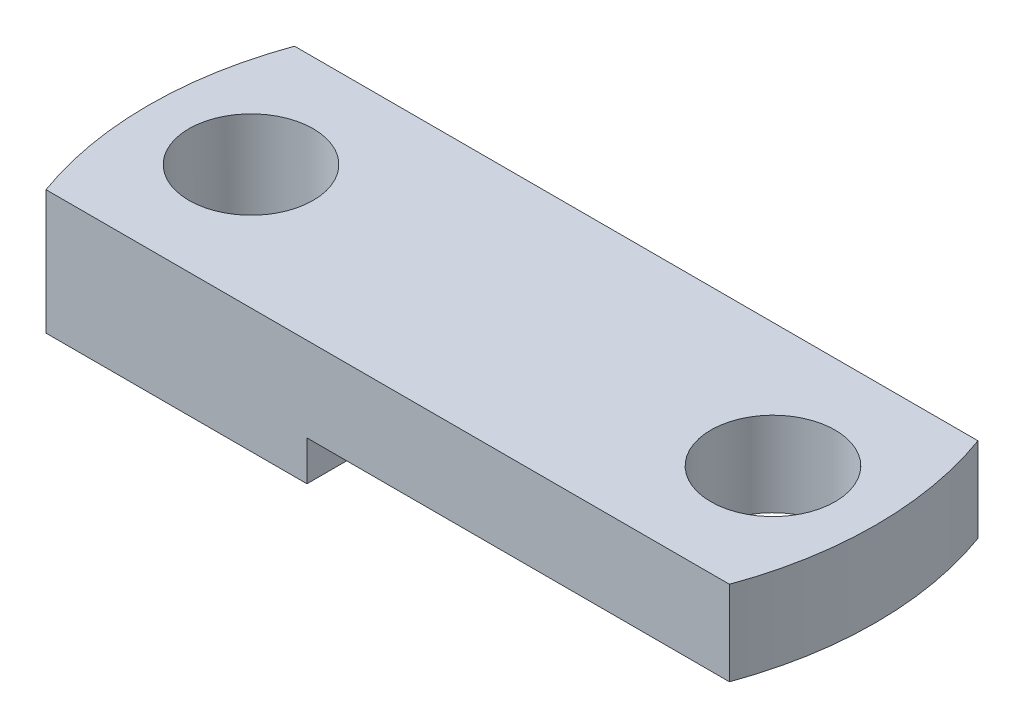
ISO-10303-21;
HEADER;
FILE_DESCRIPTION(('STEP AP214'),'2;1');
FILE_NAME('part.step','',(''),(''),'','','');
FILE_SCHEMA(('AUTOMOTIVE_DESIGN { 1 0 10303 214 1 1 1 1 }'));
ENDSEC;
DATA;
#1=APPLICATION_CONTEXT('core data for automotive mechanical design processes');
#2=APPLICATION_PROTOCOL_DEFINITION('international standard','automotive_design',2000,#1);
#3=PRODUCT_CONTEXT('',#1,'mechanical');
#4=PRODUCT('Part','Part','',(#3));
#5=PRODUCT_RELATED_PRODUCT_CATEGORY('part','',(#4));
#6=PRODUCT_DEFINITION_FORMATION('','',#4);
#7=PRODUCT_DEFINITION_CONTEXT('part definition',#1,'design');
#8=PRODUCT_DEFINITION('design','',#6,#7);
#9=PRODUCT_DEFINITION_SHAPE('','',#8);
#10=(LENGTH_UNIT() NAMED_UNIT(*) SI_UNIT(.MILLI.,.METRE.));
#11=(NAMED_UNIT(*) PLANE_ANGLE_UNIT() SI_UNIT($,.RADIAN.));
#12=(NAMED_UNIT(*) SI_UNIT($,.STERADIAN.) SOLID_ANGLE_UNIT());
#13=UNCERTAINTY_MEASURE_WITH_UNIT(LENGTH_MEASURE(1.E-05),#10,'distance_accuracy_value','');
#14=(GEOMETRIC_REPRESENTATION_CONTEXT(3) GLOBAL_UNCERTAINTY_ASSIGNED_CONTEXT((#13)) GLOBAL_UNIT_ASSIGNED_CONTEXT((#10,
#11,#12)) REPRESENTATION_CONTEXT('',''));
#15=CARTESIAN_POINT('',(0.,0.,0.));
#16=DIRECTION('',(0.,0.,1.));
#17=DIRECTION('',(1.,0.,0.));
#18=AXIS2_PLACEMENT_3D('',#15,#16,#17);
#19=CARTESIAN_POINT('',(0.,6.35,0.));
#20=DIRECTION('',(0.,-1.,0.));
#21=DIRECTION('',(0.,0.,-1.));
#22=AXIS2_PLACEMENT_3D('',#19,#20,#21);
#23=CYLINDRICAL_SURFACE('',#22,18.5812111082674);
#24=DIRECTION('',(0.,-1.,0.));
#25=VECTOR('',#24,1.);
#26=CARTESIAN_POINT('',(17.4625,6.35,6.35));
#27=LINE('',#26,#25);
#28=CARTESIAN_POINT('',(17.4625,6.35,6.35));
#29=VERTEX_POINT('',#28);
#30=CARTESIAN_POINT('',(17.4625,2.032,6.35));
#31=VERTEX_POINT('',#30);
#32=EDGE_CURVE('E119',#29,#31,#27,.T.);
#33=ORIENTED_EDGE('',*,*,#32,.T.);
#34=CARTESIAN_POINT('',(0.,2.032,0.));
#35=DIRECTION('',(0.,-1.,0.));
#36=DIRECTION('',(0.,0.,1.));
#37=AXIS2_PLACEMENT_3D('',#34,#35,#36);
#38=CIRCLE('',#37,18.5812111082674);
#39=CARTESIAN_POINT('',(17.4625,2.032,-6.35));
#40=VERTEX_POINT('',#39);
#41=EDGE_CURVE('E103',#40,#31,#38,.T.);
#42=ORIENTED_EDGE('',*,*,#41,.F.);
#43=DIRECTION('',(0.,-1.,0.));
#44=VECTOR('',#43,1.);
#45=CARTESIAN_POINT('',(17.4625,6.35,-6.35));
#46=LINE('',#45,#44);
#47=CARTESIAN_POINT('',(17.4625,6.35,-6.35));
#48=VERTEX_POINT('',#47);
#49=EDGE_CURVE('E11',#48,#40,#46,.T.);
#50=ORIENTED_EDGE('',*,*,#49,.F.);
#51=CARTESIAN_POINT('',(0.,6.35,0.));
#52=DIRECTION('',(0.,1.,0.));
#53=DIRECTION('',(0.,0.,1.));
#54=AXIS2_PLACEMENT_3D('',#51,#52,#53);
#55=CIRCLE('',#54,18.5812111082674);
#56=EDGE_CURVE('E123',#29,#48,#55,.T.);
#57=ORIENTED_EDGE('',*,*,#56,.F.);
#58=EDGE_LOOP('',(#33,#42,#50,#57));
#59=FACE_BOUND('',#58,.T.);
#60=ADVANCED_FACE('F39',(#59),#23,.T.);
#61=CARTESIAN_POINT('',(-17.4625,6.35,-6.35));
#62=DIRECTION('',(0.,0.,1.));
#63=DIRECTION('',(1.,0.,0.));
#64=AXIS2_PLACEMENT_3D('',#61,#62,#63);
#65=PLANE('',#64);
#66=DIRECTION('',(1.,0.,0.));
#67=VECTOR('',#66,1.);
#68=CARTESIAN_POINT('',(17.4625,2.032,-6.35));
#69=LINE('',#68,#67);
#70=CARTESIAN_POINT('',(-4.1275,2.032,-6.35));
#71=VERTEX_POINT('',#70);
#72=EDGE_CURVE('E110',#71,#40,#69,.T.);
#73=ORIENTED_EDGE('',*,*,#72,.F.);
#74=DIRECTION('',(0.,-1.,0.));
#75=VECTOR('',#74,1.);
#76=CARTESIAN_POINT('',(-4.1275,2.032,-6.35));
#77=LINE('',#76,#75);
#78=CARTESIAN_POINT('',(-4.1275,0.,-6.35));
#79=VERTEX_POINT('',#78);
#80=EDGE_CURVE('E160',#71,#79,#77,.T.);
#81=ORIENTED_EDGE('',*,*,#80,.T.);
#82=DIRECTION('',(-1.,0.,0.));
#83=VECTOR('',#82,1.);
#84=CARTESIAN_POINT('',(-17.4625,0.,-6.35));
#85=LINE('',#84,#83);
#86=CARTESIAN_POINT('',(-17.4625,0.,-6.35000000000001));
#87=VERTEX_POINT('',#86);
#88=EDGE_CURVE('E135',#79,#87,#85,.T.);
#89=ORIENTED_EDGE('',*,*,#88,.T.);
#90=DIRECTION('',(0.,-1.,0.));
#91=VECTOR('',#90,1.);
#92=CARTESIAN_POINT('',(-17.4625,6.35,-6.35000000000001));
#93=LINE('',#92,#91);
#94=CARTESIAN_POINT('',(-17.4625,6.35,-6.35000000000001));
#95=VERTEX_POINT('',#94);
#96=EDGE_CURVE('E47',#95,#87,#93,.T.);
#97=ORIENTED_EDGE('',*,*,#96,.F.);
#98=DIRECTION('',(-1.,0.,0.));
#99=VECTOR('',#98,1.);
#100=CARTESIAN_POINT('',(-17.4625,6.35,-6.35));
#101=LINE('',#100,#99);
#102=EDGE_CURVE('E87',#48,#95,#101,.T.);
#103=ORIENTED_EDGE('',*,*,#102,.F.);
#104=ORIENTED_EDGE('',*,*,#49,.T.);
#105=EDGE_LOOP('',(#73,#81,#89,#97,#103,#104));
#106=FACE_BOUND('',#105,.T.);
#107=ADVANCED_FACE('F162',(#106),#65,.F.);
#108=CARTESIAN_POINT('',(0.,6.35,0.));
#109=DIRECTION('',(0.,-1.,0.));
#110=DIRECTION('',(0.,0.,-1.));
#111=AXIS2_PLACEMENT_3D('',#108,#109,#110);
#112=CYLINDRICAL_SURFACE('',#111,18.5812111082674);
#113=CARTESIAN_POINT('',(0.,0.,0.));
#114=DIRECTION('',(0.,1.,0.));
#115=DIRECTION('',(0.,0.,1.));
#116=AXIS2_PLACEMENT_3D('',#113,#114,#115);
#117=CIRCLE('',#116,18.5812111082674);
#118=CARTESIAN_POINT('',(-17.4625,0.,6.35));
#119=VERTEX_POINT('',#118);
#120=EDGE_CURVE('E80',#87,#119,#117,.T.);
#121=ORIENTED_EDGE('',*,*,#120,.T.);
#122=DIRECTION('',(0.,-1.,0.));
#123=VECTOR('',#122,1.);
#124=CARTESIAN_POINT('',(-17.4625,6.35,6.35));
#125=LINE('',#124,#123);
#126=CARTESIAN_POINT('',(-17.4625,6.35,6.35));
#127=VERTEX_POINT('',#126);
#128=EDGE_CURVE('E124',#127,#119,#125,.T.);
#129=ORIENTED_EDGE('',*,*,#128,.F.);
#130=CARTESIAN_POINT('',(0.,6.35,0.));
#131=DIRECTION('',(0.,1.,0.));
#132=DIRECTION('',(0.,0.,1.));
#133=AXIS2_PLACEMENT_3D('',#130,#131,#132);
#134=CIRCLE('',#133,18.5812111082674);
#135=EDGE_CURVE('E127',#95,#127,#134,.T.);
#136=ORIENTED_EDGE('',*,*,#135,.F.);
#137=ORIENTED_EDGE('',*,*,#96,.T.);
#138=EDGE_LOOP('',(#121,#129,#136,#137));
#139=FACE_BOUND('',#138,.T.);
#140=ADVANCED_FACE('F164',(#139),#112,.T.);
#141=CARTESIAN_POINT('',(-17.4625,6.35,6.35));
#142=DIRECTION('',(0.,0.,-1.));
#143=DIRECTION('',(-1.,0.,0.));
#144=AXIS2_PLACEMENT_3D('',#141,#142,#143);
#145=PLANE('',#144);
#146=DIRECTION('',(1.,0.,0.));
#147=VECTOR('',#146,1.);
#148=CARTESIAN_POINT('',(-17.4625,0.,6.35));
#149=LINE('',#148,#147);
#150=CARTESIAN_POINT('',(-4.1275,0.,6.35));
#151=VERTEX_POINT('',#150);
#152=EDGE_CURVE('E130',#119,#151,#149,.T.);
#153=ORIENTED_EDGE('',*,*,#152,.T.);
#154=DIRECTION('',(0.,-1.,0.));
#155=VECTOR('',#154,1.);
#156=CARTESIAN_POINT('',(-4.1275,2.032,6.35));
#157=LINE('',#156,#155);
#158=CARTESIAN_POINT('',(-4.1275,2.032,6.35));
#159=VERTEX_POINT('',#158);
#160=EDGE_CURVE('E55',#159,#151,#157,.T.);
#161=ORIENTED_EDGE('',*,*,#160,.F.);
#162=DIRECTION('',(-1.,0.,0.));
#163=VECTOR('',#162,1.);
#164=CARTESIAN_POINT('',(17.4625,2.032,6.35));
#165=LINE('',#164,#163);
#166=EDGE_CURVE('E108',#31,#159,#165,.T.);
#167=ORIENTED_EDGE('',*,*,#166,.F.);
#168=ORIENTED_EDGE('',*,*,#32,.F.);
#169=DIRECTION('',(1.,0.,0.));
#170=VECTOR('',#169,1.);
#171=CARTESIAN_POINT('',(-17.4625,6.35,6.35));
#172=LINE('',#171,#170);
#173=EDGE_CURVE('E64',#127,#29,#172,.T.);
#174=ORIENTED_EDGE('',*,*,#173,.F.);
#175=ORIENTED_EDGE('',*,*,#128,.T.);
#176=EDGE_LOOP('',(#153,#161,#167,#168,#174,#175));
#177=FACE_BOUND('',#176,.T.);
#178=ADVANCED_FACE('F118',(#177),#145,.F.);
#179=CARTESIAN_POINT('',(0.,6.35,0.));
#180=DIRECTION('',(0.,1.,0.));
#181=DIRECTION('',(0.,0.,1.));
#182=AXIS2_PLACEMENT_3D('',#179,#180,#181);
#183=PLANE('',#182);
#184=CARTESIAN_POINT('',(-13.335,6.35,0.));
#185=DIRECTION('',(0.,1.,0.));
#186=DIRECTION('',(0.,0.,-1.));
#187=AXIS2_PLACEMENT_3D('',#184,#185,#186);
#188=CIRCLE('',#187,3.175);
#189=CARTESIAN_POINT('',(-13.335,6.35,-3.175));
#190=VERTEX_POINT('',#189);
#191=EDGE_CURVE('E136',#190,#190,#188,.T.);
#192=ORIENTED_EDGE('',*,*,#191,.F.);
#193=EDGE_LOOP('',(#192));
#194=FACE_BOUND('',#193,.T.);
#195=CARTESIAN_POINT('',(13.335,6.35,0.));
#196=DIRECTION('',(0.,1.,0.));
#197=DIRECTION('',(0.,0.,1.));
#198=AXIS2_PLACEMENT_3D('',#195,#196,#197);
#199=CIRCLE('',#198,3.175);
#200=CARTESIAN_POINT('',(13.335,6.35,3.175));
#201=VERTEX_POINT('',#200);
#202=EDGE_CURVE('E141',#201,#201,#199,.T.);
#203=ORIENTED_EDGE('',*,*,#202,.F.);
#204=EDGE_LOOP('',(#203));
#205=FACE_BOUND('',#204,.T.);
#206=ORIENTED_EDGE('',*,*,#56,.T.);
#207=ORIENTED_EDGE('',*,*,#102,.T.);
#208=ORIENTED_EDGE('',*,*,#135,.T.);
#209=ORIENTED_EDGE('',*,*,#173,.T.);
#210=EDGE_LOOP('',(#206,#207,#208,#209));
#211=FACE_BOUND('',#210,.T.);
#212=ADVANCED_FACE('F173',(#194,#205,#211),#183,.T.);
#213=CARTESIAN_POINT('',(0.,0.,0.));
#214=DIRECTION('',(0.,1.,0.));
#215=DIRECTION('',(0.,0.,1.));
#216=AXIS2_PLACEMENT_3D('',#213,#214,#215);
#217=PLANE('',#216);
#218=CARTESIAN_POINT('',(-13.335,0.,0.));
#219=DIRECTION('',(0.,1.,0.));
#220=DIRECTION('',(0.,0.,1.));
#221=AXIS2_PLACEMENT_3D('',#218,#219,#220);
#222=CIRCLE('',#221,3.175);
#223=CARTESIAN_POINT('',(-13.335,0.,3.175));
#224=VERTEX_POINT('',#223);
#225=EDGE_CURVE('E133',#224,#224,#222,.T.);
#226=ORIENTED_EDGE('',*,*,#225,.T.);
#227=EDGE_LOOP('',(#226));
#228=FACE_BOUND('',#227,.T.);
#229=ORIENTED_EDGE('',*,*,#88,.F.);
#230=DIRECTION('',(0.,0.,-1.));
#231=VECTOR('',#230,1.);
#232=CARTESIAN_POINT('',(-4.1275,0.,6.35));
#233=LINE('',#232,#231);
#234=EDGE_CURVE('E114',#151,#79,#233,.T.);
#235=ORIENTED_EDGE('',*,*,#234,.F.);
#236=ORIENTED_EDGE('',*,*,#152,.F.);
#237=ORIENTED_EDGE('',*,*,#120,.F.);
#238=EDGE_LOOP('',(#229,#235,#236,#237));
#239=FACE_BOUND('',#238,.T.);
#240=ADVANCED_FACE('F155',(#228,#239),#217,.F.);
#241=CARTESIAN_POINT('',(13.335,-6.35,0.));
#242=DIRECTION('',(0.,1.,0.));
#243=DIRECTION('',(0.,0.,1.));
#244=AXIS2_PLACEMENT_3D('',#241,#242,#243);
#245=CYLINDRICAL_SURFACE('',#244,3.175);
#246=CARTESIAN_POINT('',(13.335,2.032,0.));
#247=DIRECTION('',(0.,1.,0.));
#248=DIRECTION('',(0.,0.,1.));
#249=AXIS2_PLACEMENT_3D('',#246,#247,#248);
#250=CIRCLE('',#249,3.175);
#251=CARTESIAN_POINT('',(13.335,2.032,3.175));
#252=VERTEX_POINT('',#251);
#253=EDGE_CURVE('E42',#252,#252,#250,.F.);
#254=ORIENTED_EDGE('',*,*,#253,.T.);
#255=EDGE_LOOP('',(#254));
#256=FACE_BOUND('',#255,.T.);
#257=ORIENTED_EDGE('',*,*,#202,.T.);
#258=EDGE_LOOP('',(#257));
#259=FACE_BOUND('',#258,.T.);
#260=ADVANCED_FACE('F176',(#256,#259),#245,.F.);
#261=CARTESIAN_POINT('',(-13.335,-6.35,0.));
#262=DIRECTION('',(0.,1.,0.));
#263=DIRECTION('',(0.,0.,1.));
#264=AXIS2_PLACEMENT_3D('',#261,#262,#263);
#265=CYLINDRICAL_SURFACE('',#264,3.175);
#266=ORIENTED_EDGE('',*,*,#191,.T.);
#267=EDGE_LOOP('',(#266));
#268=FACE_BOUND('',#267,.T.);
#269=ORIENTED_EDGE('',*,*,#225,.F.);
#270=EDGE_LOOP('',(#269));
#271=FACE_BOUND('',#270,.T.);
#272=ADVANCED_FACE('F182',(#268,#271),#265,.F.);
#273=CARTESIAN_POINT('',(0.,2.032,0.));
#274=DIRECTION('',(0.,1.,0.));
#275=DIRECTION('',(0.,0.,1.));
#276=AXIS2_PLACEMENT_3D('',#273,#274,#275);
#277=PLANE('',#276);
#278=ORIENTED_EDGE('',*,*,#41,.T.);
#279=ORIENTED_EDGE('',*,*,#166,.T.);
#280=DIRECTION('',(0.,0.,-1.));
#281=VECTOR('',#280,1.);
#282=CARTESIAN_POINT('',(-4.1275,2.032,6.35));
#283=LINE('',#282,#281);
#284=EDGE_CURVE('E121',#159,#71,#283,.T.);
#285=ORIENTED_EDGE('',*,*,#284,.T.);
#286=ORIENTED_EDGE('',*,*,#72,.T.);
#287=EDGE_LOOP('',(#278,#279,#285,#286));
#288=FACE_BOUND('',#287,.T.);
#289=ORIENTED_EDGE('',*,*,#253,.F.);
#290=EDGE_LOOP('',(#289));
#291=FACE_BOUND('',#290,.T.);
#292=ADVANCED_FACE('F105',(#288,#291),#277,.F.);
#293=CARTESIAN_POINT('',(-4.1275,2.032,6.35));
#294=DIRECTION('',(-1.,0.,0.));
#295=DIRECTION('',(0.,0.,1.));
#296=AXIS2_PLACEMENT_3D('',#293,#294,#295);
#297=PLANE('',#296);
#298=ORIENTED_EDGE('',*,*,#234,.T.);
#299=ORIENTED_EDGE('',*,*,#80,.F.);
#300=ORIENTED_EDGE('',*,*,#284,.F.);
#301=ORIENTED_EDGE('',*,*,#160,.T.);
#302=EDGE_LOOP('',(#298,#299,#300,#301));
#303=FACE_BOUND('',#302,.T.);
#304=ADVANCED_FACE('F186',(#303),#297,.F.);
#305=CLOSED_SHELL('',(#60,#107,#140,#178,#212,#240,#260,#272,#292,#304));
#306=MANIFOLD_SOLID_BREP('B2',#305);
#307=ADVANCED_BREP_SHAPE_REPRESENTATION('',(#18,#306),#14);
#308=SHAPE_DEFINITION_REPRESENTATION(#9,#307);
ENDSEC;
END-ISO-10303-21;
